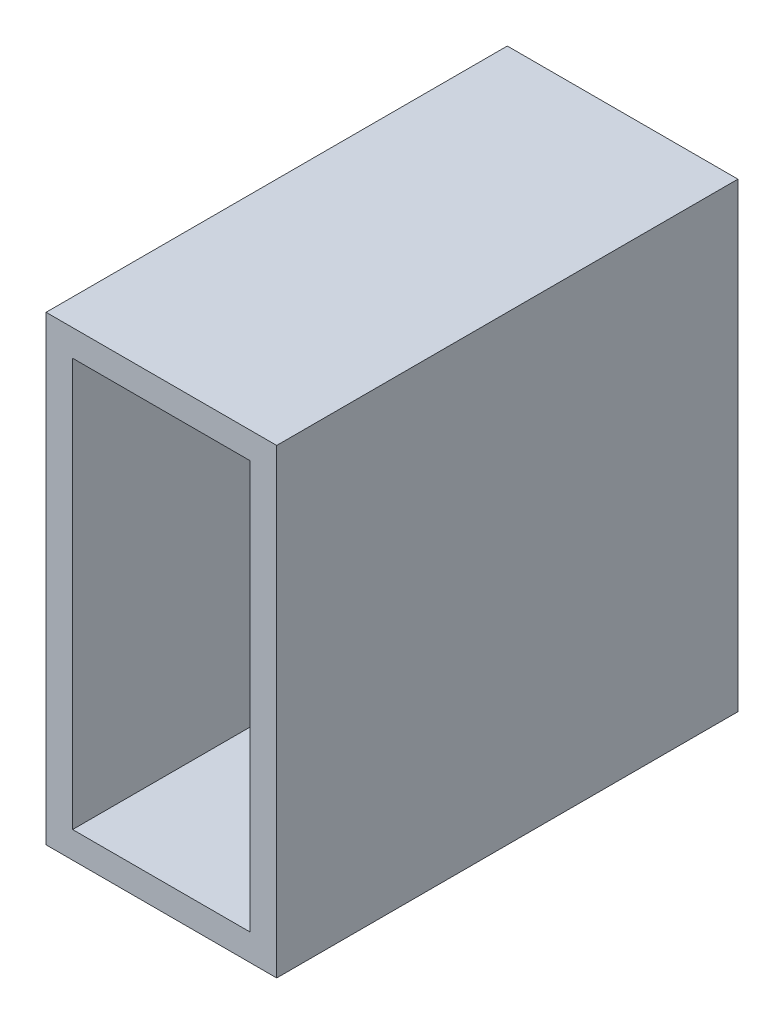
ISO-10303-21;
HEADER;
FILE_DESCRIPTION(('STEP AP214'),'2;1');
FILE_NAME('part.step','',(''),(''),'','','');
FILE_SCHEMA(('AUTOMOTIVE_DESIGN { 1 0 10303 214 1 1 1 1 }'));
ENDSEC;
DATA;
#1=APPLICATION_CONTEXT('core data for automotive mechanical design processes');
#2=APPLICATION_PROTOCOL_DEFINITION('international standard','automotive_design',2000,#1);
#3=PRODUCT_CONTEXT('',#1,'mechanical');
#4=PRODUCT('Part','Part','',(#3));
#5=PRODUCT_RELATED_PRODUCT_CATEGORY('part','',(#4));
#6=PRODUCT_DEFINITION_FORMATION('','',#4);
#7=PRODUCT_DEFINITION_CONTEXT('part definition',#1,'design');
#8=PRODUCT_DEFINITION('design','',#6,#7);
#9=PRODUCT_DEFINITION_SHAPE('','',#8);
#10=(LENGTH_UNIT() NAMED_UNIT(*) SI_UNIT(.MILLI.,.METRE.));
#11=(NAMED_UNIT(*) PLANE_ANGLE_UNIT() SI_UNIT($,.RADIAN.));
#12=(NAMED_UNIT(*) SI_UNIT($,.STERADIAN.) SOLID_ANGLE_UNIT());
#13=UNCERTAINTY_MEASURE_WITH_UNIT(LENGTH_MEASURE(1.E-05),#10,'distance_accuracy_value','');
#14=(GEOMETRIC_REPRESENTATION_CONTEXT(3) GLOBAL_UNCERTAINTY_ASSIGNED_CONTEXT((#13)) GLOBAL_UNIT_ASSIGNED_CONTEXT((#10,
#11,#12)) REPRESENTATION_CONTEXT('',''));
#15=CARTESIAN_POINT('',(0.,0.,0.));
#16=DIRECTION('',(0.,0.,1.));
#17=DIRECTION('',(1.,0.,0.));
#18=AXIS2_PLACEMENT_3D('',#15,#16,#17);
#19=CARTESIAN_POINT('',(0.,0.,50.8));
#20=DIRECTION('',(0.,0.,-1.));
#21=DIRECTION('',(-1.,0.,0.));
#22=AXIS2_PLACEMENT_3D('',#19,#20,#21);
#23=PLANE('',#22);
#24=DIRECTION('',(0.,1.,0.));
#25=VECTOR('',#24,1.);
#26=CARTESIAN_POINT('',(12.7,-25.4,50.8));
#27=LINE('',#26,#25);
#28=CARTESIAN_POINT('',(12.7,-25.4,50.8));
#29=VERTEX_POINT('',#28);
#30=CARTESIAN_POINT('',(12.7,25.4,50.8));
#31=VERTEX_POINT('',#30);
#32=EDGE_CURVE('E140',#29,#31,#27,.T.);
#33=ORIENTED_EDGE('',*,*,#32,.T.);
#34=DIRECTION('',(-1.,0.,0.));
#35=VECTOR('',#34,1.);
#36=CARTESIAN_POINT('',(-12.7,25.4,50.8));
#37=LINE('',#36,#35);
#38=CARTESIAN_POINT('',(-12.7,25.4,50.8));
#39=VERTEX_POINT('',#38);
#40=EDGE_CURVE('E143',#31,#39,#37,.T.);
#41=ORIENTED_EDGE('',*,*,#40,.T.);
#42=DIRECTION('',(0.,-1.,0.));
#43=VECTOR('',#42,1.);
#44=CARTESIAN_POINT('',(-12.7,-25.4,50.8));
#45=LINE('',#44,#43);
#46=CARTESIAN_POINT('',(-12.7,-25.4,50.8));
#47=VERTEX_POINT('',#46);
#48=EDGE_CURVE('E146',#39,#47,#45,.T.);
#49=ORIENTED_EDGE('',*,*,#48,.T.);
#50=DIRECTION('',(1.,0.,0.));
#51=VECTOR('',#50,1.);
#52=CARTESIAN_POINT('',(-12.7,-25.4,50.8));
#53=LINE('',#52,#51);
#54=EDGE_CURVE('E148',#47,#29,#53,.T.);
#55=ORIENTED_EDGE('',*,*,#54,.T.);
#56=EDGE_LOOP('',(#33,#41,#49,#55));
#57=FACE_BOUND('',#56,.T.);
#58=DIRECTION('',(0.,-1.,0.));
#59=VECTOR('',#58,1.);
#60=CARTESIAN_POINT('',(-9.779,-22.479,50.8));
#61=LINE('',#60,#59);
#62=CARTESIAN_POINT('',(-9.779,22.479,50.8));
#63=VERTEX_POINT('',#62);
#64=CARTESIAN_POINT('',(-9.779,-22.479,50.8));
#65=VERTEX_POINT('',#64);
#66=EDGE_CURVE('E104',#63,#65,#61,.T.);
#67=ORIENTED_EDGE('',*,*,#66,.F.);
#68=DIRECTION('',(-1.,0.,0.));
#69=VECTOR('',#68,1.);
#70=CARTESIAN_POINT('',(-9.779,22.479,50.8));
#71=LINE('',#70,#69);
#72=CARTESIAN_POINT('',(9.779,22.479,50.8));
#73=VERTEX_POINT('',#72);
#74=EDGE_CURVE('E126',#73,#63,#71,.T.);
#75=ORIENTED_EDGE('',*,*,#74,.F.);
#76=DIRECTION('',(0.,1.,0.));
#77=VECTOR('',#76,1.);
#78=CARTESIAN_POINT('',(9.779,-22.479,50.8));
#79=LINE('',#78,#77);
#80=CARTESIAN_POINT('',(9.779,-22.479,50.8));
#81=VERTEX_POINT('',#80);
#82=EDGE_CURVE('E124',#81,#73,#79,.T.);
#83=ORIENTED_EDGE('',*,*,#82,.F.);
#84=DIRECTION('',(1.,0.,0.));
#85=VECTOR('',#84,1.);
#86=CARTESIAN_POINT('',(-9.779,-22.479,50.8));
#87=LINE('',#86,#85);
#88=EDGE_CURVE('E112',#65,#81,#87,.T.);
#89=ORIENTED_EDGE('',*,*,#88,.F.);
#90=EDGE_LOOP('',(#67,#75,#83,#89));
#91=FACE_BOUND('',#90,.T.);
#92=ADVANCED_FACE('F39',(#57,#91),#23,.F.);
#93=CARTESIAN_POINT('',(0.,0.,0.));
#94=DIRECTION('',(0.,0.,-1.));
#95=DIRECTION('',(-1.,0.,0.));
#96=AXIS2_PLACEMENT_3D('',#93,#94,#95);
#97=PLANE('',#96);
#98=DIRECTION('',(0.,1.,0.));
#99=VECTOR('',#98,1.);
#100=CARTESIAN_POINT('',(12.7,-25.4,0.));
#101=LINE('',#100,#99);
#102=CARTESIAN_POINT('',(12.7,-25.4,0.));
#103=VERTEX_POINT('',#102);
#104=CARTESIAN_POINT('',(12.7,25.4,0.));
#105=VERTEX_POINT('',#104);
#106=EDGE_CURVE('E120',#103,#105,#101,.T.);
#107=ORIENTED_EDGE('',*,*,#106,.F.);
#108=DIRECTION('',(1.,0.,0.));
#109=VECTOR('',#108,1.);
#110=CARTESIAN_POINT('',(-12.7,-25.4,0.));
#111=LINE('',#110,#109);
#112=CARTESIAN_POINT('',(-12.7,-25.4,0.));
#113=VERTEX_POINT('',#112);
#114=EDGE_CURVE('E144',#113,#103,#111,.T.);
#115=ORIENTED_EDGE('',*,*,#114,.F.);
#116=DIRECTION('',(0.,-1.,0.));
#117=VECTOR('',#116,1.);
#118=CARTESIAN_POINT('',(-12.7,-25.4,0.));
#119=LINE('',#118,#117);
#120=CARTESIAN_POINT('',(-12.7,25.4,0.));
#121=VERTEX_POINT('',#120);
#122=EDGE_CURVE('E155',#121,#113,#119,.T.);
#123=ORIENTED_EDGE('',*,*,#122,.F.);
#124=DIRECTION('',(-1.,0.,0.));
#125=VECTOR('',#124,1.);
#126=CARTESIAN_POINT('',(-12.7,25.4,0.));
#127=LINE('',#126,#125);
#128=EDGE_CURVE('E153',#105,#121,#127,.T.);
#129=ORIENTED_EDGE('',*,*,#128,.F.);
#130=EDGE_LOOP('',(#107,#115,#123,#129));
#131=FACE_BOUND('',#130,.T.);
#132=DIRECTION('',(-1.,0.,0.));
#133=VECTOR('',#132,1.);
#134=CARTESIAN_POINT('',(-9.779,22.479,0.));
#135=LINE('',#134,#133);
#136=CARTESIAN_POINT('',(9.779,22.479,0.));
#137=VERTEX_POINT('',#136);
#138=CARTESIAN_POINT('',(-9.779,22.479,0.));
#139=VERTEX_POINT('',#138);
#140=EDGE_CURVE('E113',#137,#139,#135,.T.);
#141=ORIENTED_EDGE('',*,*,#140,.T.);
#142=DIRECTION('',(0.,-1.,0.));
#143=VECTOR('',#142,1.);
#144=CARTESIAN_POINT('',(-9.779,-22.479,0.));
#145=LINE('',#144,#143);
#146=CARTESIAN_POINT('',(-9.779,-22.479,0.));
#147=VERTEX_POINT('',#146);
#148=EDGE_CURVE('E62',#139,#147,#145,.T.);
#149=ORIENTED_EDGE('',*,*,#148,.T.);
#150=DIRECTION('',(1.,0.,0.));
#151=VECTOR('',#150,1.);
#152=CARTESIAN_POINT('',(-9.779,-22.479,0.));
#153=LINE('',#152,#151);
#154=CARTESIAN_POINT('',(9.779,-22.479,0.));
#155=VERTEX_POINT('',#154);
#156=EDGE_CURVE('E119',#147,#155,#153,.T.);
#157=ORIENTED_EDGE('',*,*,#156,.T.);
#158=DIRECTION('',(0.,1.,0.));
#159=VECTOR('',#158,1.);
#160=CARTESIAN_POINT('',(9.779,-22.479,0.));
#161=LINE('',#160,#159);
#162=EDGE_CURVE('E132',#155,#137,#161,.T.);
#163=ORIENTED_EDGE('',*,*,#162,.T.);
#164=EDGE_LOOP('',(#141,#149,#157,#163));
#165=FACE_BOUND('',#164,.T.);
#166=ADVANCED_FACE('F173',(#131,#165),#97,.T.);
#167=CARTESIAN_POINT('',(12.7,-25.4,50.8));
#168=DIRECTION('',(-1.,0.,0.));
#169=DIRECTION('',(0.,0.,1.));
#170=AXIS2_PLACEMENT_3D('',#167,#168,#169);
#171=PLANE('',#170);
#172=ORIENTED_EDGE('',*,*,#106,.T.);
#173=DIRECTION('',(0.,0.,-1.));
#174=VECTOR('',#173,1.);
#175=CARTESIAN_POINT('',(12.7,25.4,50.8));
#176=LINE('',#175,#174);
#177=EDGE_CURVE('E11',#31,#105,#176,.T.);
#178=ORIENTED_EDGE('',*,*,#177,.F.);
#179=ORIENTED_EDGE('',*,*,#32,.F.);
#180=DIRECTION('',(0.,0.,-1.));
#181=VECTOR('',#180,1.);
#182=CARTESIAN_POINT('',(12.7,-25.4,50.8));
#183=LINE('',#182,#181);
#184=EDGE_CURVE('E150',#29,#103,#183,.T.);
#185=ORIENTED_EDGE('',*,*,#184,.T.);
#186=EDGE_LOOP('',(#172,#178,#179,#185));
#187=FACE_BOUND('',#186,.T.);
#188=ADVANCED_FACE('F41',(#187),#171,.F.);
#189=CARTESIAN_POINT('',(-12.7,25.4,50.8));
#190=DIRECTION('',(0.,-1.,0.));
#191=DIRECTION('',(0.,0.,-1.));
#192=AXIS2_PLACEMENT_3D('',#189,#190,#191);
#193=PLANE('',#192);
#194=ORIENTED_EDGE('',*,*,#128,.T.);
#195=DIRECTION('',(0.,0.,-1.));
#196=VECTOR('',#195,1.);
#197=CARTESIAN_POINT('',(-12.7,25.4,50.8));
#198=LINE('',#197,#196);
#199=EDGE_CURVE('E47',#39,#121,#198,.T.);
#200=ORIENTED_EDGE('',*,*,#199,.F.);
#201=ORIENTED_EDGE('',*,*,#40,.F.);
#202=ORIENTED_EDGE('',*,*,#177,.T.);
#203=EDGE_LOOP('',(#194,#200,#201,#202));
#204=FACE_BOUND('',#203,.T.);
#205=ADVANCED_FACE('F183',(#204),#193,.F.);
#206=CARTESIAN_POINT('',(-12.7,-25.4,50.8));
#207=DIRECTION('',(1.,0.,0.));
#208=DIRECTION('',(0.,0.,-1.));
#209=AXIS2_PLACEMENT_3D('',#206,#207,#208);
#210=PLANE('',#209);
#211=ORIENTED_EDGE('',*,*,#122,.T.);
#212=DIRECTION('',(0.,0.,-1.));
#213=VECTOR('',#212,1.);
#214=CARTESIAN_POINT('',(-12.7,-25.4,50.8));
#215=LINE('',#214,#213);
#216=EDGE_CURVE('E160',#47,#113,#215,.T.);
#217=ORIENTED_EDGE('',*,*,#216,.F.);
#218=ORIENTED_EDGE('',*,*,#48,.F.);
#219=ORIENTED_EDGE('',*,*,#199,.T.);
#220=EDGE_LOOP('',(#211,#217,#218,#219));
#221=FACE_BOUND('',#220,.T.);
#222=ADVANCED_FACE('F167',(#221),#210,.F.);
#223=CARTESIAN_POINT('',(-12.7,-25.4,50.8));
#224=DIRECTION('',(0.,1.,0.));
#225=DIRECTION('',(0.,0.,1.));
#226=AXIS2_PLACEMENT_3D('',#223,#224,#225);
#227=PLANE('',#226);
#228=ORIENTED_EDGE('',*,*,#114,.T.);
#229=ORIENTED_EDGE('',*,*,#184,.F.);
#230=ORIENTED_EDGE('',*,*,#54,.F.);
#231=ORIENTED_EDGE('',*,*,#216,.T.);
#232=EDGE_LOOP('',(#228,#229,#230,#231));
#233=FACE_BOUND('',#232,.T.);
#234=ADVANCED_FACE('F177',(#233),#227,.F.);
#235=CARTESIAN_POINT('',(-9.779,-22.479,50.8));
#236=DIRECTION('',(1.,0.,0.));
#237=DIRECTION('',(0.,0.,-1.));
#238=AXIS2_PLACEMENT_3D('',#235,#236,#237);
#239=PLANE('',#238);
#240=ORIENTED_EDGE('',*,*,#148,.F.);
#241=DIRECTION('',(0.,0.,-1.));
#242=VECTOR('',#241,1.);
#243=CARTESIAN_POINT('',(-9.779,22.479,50.8));
#244=LINE('',#243,#242);
#245=EDGE_CURVE('E108',#63,#139,#244,.T.);
#246=ORIENTED_EDGE('',*,*,#245,.F.);
#247=ORIENTED_EDGE('',*,*,#66,.T.);
#248=DIRECTION('',(0.,0.,-1.));
#249=VECTOR('',#248,1.);
#250=CARTESIAN_POINT('',(-9.779,-22.479,50.8));
#251=LINE('',#250,#249);
#252=EDGE_CURVE('E107',#65,#147,#251,.T.);
#253=ORIENTED_EDGE('',*,*,#252,.T.);
#254=EDGE_LOOP('',(#240,#246,#247,#253));
#255=FACE_BOUND('',#254,.T.);
#256=ADVANCED_FACE('F106',(#255),#239,.T.);
#257=CARTESIAN_POINT('',(-9.779,-22.479,50.8));
#258=DIRECTION('',(0.,1.,0.));
#259=DIRECTION('',(0.,0.,1.));
#260=AXIS2_PLACEMENT_3D('',#257,#258,#259);
#261=PLANE('',#260);
#262=ORIENTED_EDGE('',*,*,#156,.F.);
#263=ORIENTED_EDGE('',*,*,#252,.F.);
#264=ORIENTED_EDGE('',*,*,#88,.T.);
#265=DIRECTION('',(0.,0.,-1.));
#266=VECTOR('',#265,1.);
#267=CARTESIAN_POINT('',(9.779,-22.479,50.8));
#268=LINE('',#267,#266);
#269=EDGE_CURVE('E121',#81,#155,#268,.T.);
#270=ORIENTED_EDGE('',*,*,#269,.T.);
#271=EDGE_LOOP('',(#262,#263,#264,#270));
#272=FACE_BOUND('',#271,.T.);
#273=ADVANCED_FACE('F116',(#272),#261,.T.);
#274=CARTESIAN_POINT('',(9.779,-22.479,50.8));
#275=DIRECTION('',(-1.,0.,0.));
#276=DIRECTION('',(0.,0.,1.));
#277=AXIS2_PLACEMENT_3D('',#274,#275,#276);
#278=PLANE('',#277);
#279=ORIENTED_EDGE('',*,*,#162,.F.);
#280=ORIENTED_EDGE('',*,*,#269,.F.);
#281=ORIENTED_EDGE('',*,*,#82,.T.);
#282=DIRECTION('',(0.,0.,-1.));
#283=VECTOR('',#282,1.);
#284=CARTESIAN_POINT('',(9.779,22.479,50.8));
#285=LINE('',#284,#283);
#286=EDGE_CURVE('E54',#73,#137,#285,.T.);
#287=ORIENTED_EDGE('',*,*,#286,.T.);
#288=EDGE_LOOP('',(#279,#280,#281,#287));
#289=FACE_BOUND('',#288,.T.);
#290=ADVANCED_FACE('F206',(#289),#278,.T.);
#291=CARTESIAN_POINT('',(-9.779,22.479,50.8));
#292=DIRECTION('',(0.,-1.,0.));
#293=DIRECTION('',(0.,0.,-1.));
#294=AXIS2_PLACEMENT_3D('',#291,#292,#293);
#295=PLANE('',#294);
#296=ORIENTED_EDGE('',*,*,#140,.F.);
#297=ORIENTED_EDGE('',*,*,#286,.F.);
#298=ORIENTED_EDGE('',*,*,#74,.T.);
#299=ORIENTED_EDGE('',*,*,#245,.T.);
#300=EDGE_LOOP('',(#296,#297,#298,#299));
#301=FACE_BOUND('',#300,.T.);
#302=ADVANCED_FACE('F210',(#301),#295,.T.);
#303=CLOSED_SHELL('',(#92,#166,#188,#205,#222,#234,#256,#273,#290,#302));
#304=MANIFOLD_SOLID_BREP('B2',#303);
#305=ADVANCED_BREP_SHAPE_REPRESENTATION('',(#18,#304),#14);
#306=SHAPE_DEFINITION_REPRESENTATION(#9,#305);
ENDSEC;
END-ISO-10303-21;
